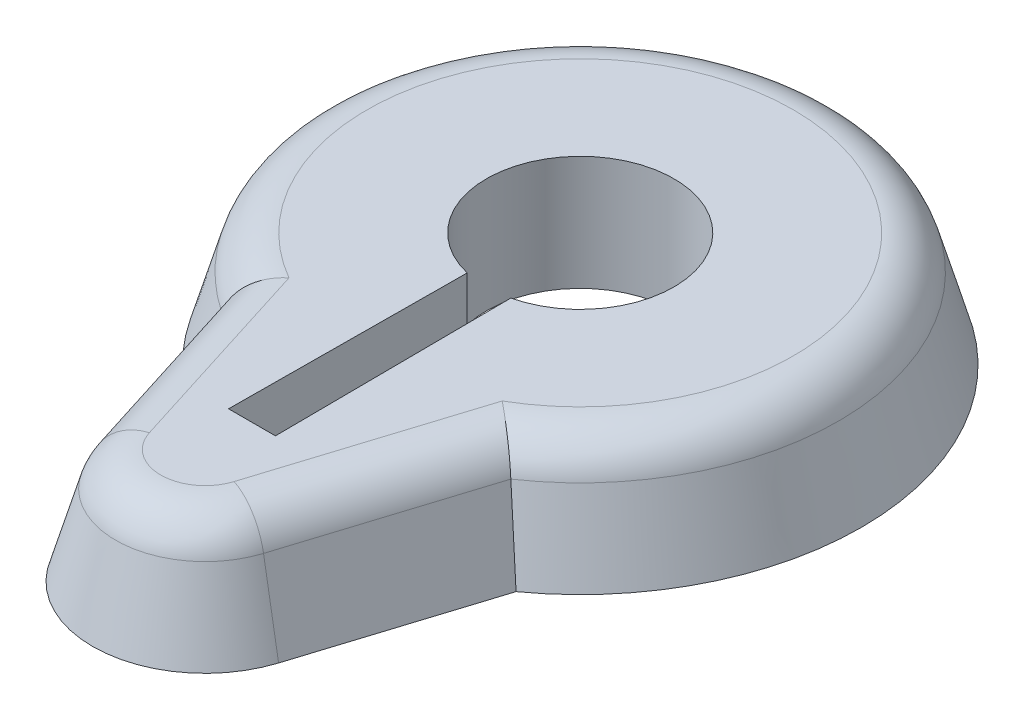
ISO-10303-21;
HEADER;
FILE_DESCRIPTION(('STEP AP214'),'2;1');
FILE_NAME('part.step','',(''),(''),'','','');
FILE_SCHEMA(('AUTOMOTIVE_DESIGN { 1 0 10303 214 1 1 1 1 }'));
ENDSEC;
DATA;
#1=APPLICATION_CONTEXT('core data for automotive mechanical design processes');
#2=APPLICATION_PROTOCOL_DEFINITION('international standard','automotive_design',2000,#1);
#3=PRODUCT_CONTEXT('',#1,'mechanical');
#4=PRODUCT('Part','Part','',(#3));
#5=PRODUCT_RELATED_PRODUCT_CATEGORY('part','',(#4));
#6=PRODUCT_DEFINITION_FORMATION('','',#4);
#7=PRODUCT_DEFINITION_CONTEXT('part definition',#1,'design');
#8=PRODUCT_DEFINITION('design','',#6,#7);
#9=PRODUCT_DEFINITION_SHAPE('','',#8);
#10=(LENGTH_UNIT() NAMED_UNIT(*) SI_UNIT(.MILLI.,.METRE.));
#11=(NAMED_UNIT(*) PLANE_ANGLE_UNIT() SI_UNIT($,.RADIAN.));
#12=(NAMED_UNIT(*) SI_UNIT($,.STERADIAN.) SOLID_ANGLE_UNIT());
#13=UNCERTAINTY_MEASURE_WITH_UNIT(LENGTH_MEASURE(1.E-05),#10,'distance_accuracy_value','');
#14=(GEOMETRIC_REPRESENTATION_CONTEXT(3) GLOBAL_UNCERTAINTY_ASSIGNED_CONTEXT((#13)) GLOBAL_UNIT_ASSIGNED_CONTEXT((#10,
#11,#12)) REPRESENTATION_CONTEXT('',''));
#15=CARTESIAN_POINT('',(0.,0.,0.));
#16=DIRECTION('',(0.,0.,1.));
#17=DIRECTION('',(1.,0.,0.));
#18=AXIS2_PLACEMENT_3D('',#15,#16,#17);
#19=CARTESIAN_POINT('',(0.,0.,-2.));
#20=DIRECTION('',(0.,-1.,0.));
#21=DIRECTION('',(0.,0.,1.));
#22=AXIS2_PLACEMENT_3D('',#19,#20,#21);
#23=CONICAL_SURFACE('',#22,1.5,0.279252680319093);
#24=CARTESIAN_POINT('',(-0.727011983445059,0.61,-0.892162165690795));
#25=CARTESIAN_POINT('',(-0.751687573822711,0.508364701078638,-0.873506309394445));
#26=CARTESIAN_POINT('',(-0.776419229257601,0.406713709937173,-0.855013305041109));
#27=CARTESIAN_POINT('',(-0.825994662103472,0.203380376593568,-0.818353006238683));
#28=CARTESIAN_POINT('',(-0.850838439477637,0.101698034401733,-0.800185711682655));
#29=CARTESIAN_POINT('',(-0.875738281872226,0.,-0.782181268962706));
#30=B_SPLINE_CURVE_WITH_KNOTS('',3,(#24,#25,#26,#27,#28,#29),.UNSPECIFIED.,.F.,.F.,(4,2,4),(0.,
0.318714809689546,0.63742951473762),.UNSPECIFIED.);
#31=CARTESIAN_POINT('',(-0.771031625107619,0.428909338953996,-0.859091193810965));
#32=VERTEX_POINT('',#31);
#33=CARTESIAN_POINT('',(-0.875738281872566,0.,-0.78218126896369));
#34=VERTEX_POINT('',#33);
#35=EDGE_CURVE('E161',#32,#34,#30,.T.);
#36=ORIENTED_EDGE('',*,*,#35,.F.);
#37=CARTESIAN_POINT('',(0.,0.42890933895425,-2.));
#38=DIRECTION('',(0.,-1.,0.));
#39=DIRECTION('',(0.,0.,-1.));
#40=AXIS2_PLACEMENT_3D('',#37,#38,#39);
#41=CIRCLE('',#40,1.37701222614601);
#42=CARTESIAN_POINT('',(0.771031625107556,0.428909338954256,-0.859091193811012));
#43=VERTEX_POINT('',#42);
#44=EDGE_CURVE('E11',#32,#43,#41,.T.);
#45=ORIENTED_EDGE('',*,*,#44,.T.);
#46=CARTESIAN_POINT('',(0.727011983445059,0.61,-0.892162165690795));
#47=CARTESIAN_POINT('',(0.751687573822711,0.508364701078638,-0.873506309394445));
#48=CARTESIAN_POINT('',(0.776419229257601,0.406713709937173,-0.855013305041109));
#49=CARTESIAN_POINT('',(0.825994662103471,0.203380376593568,-0.818353006238682));
#50=CARTESIAN_POINT('',(0.850838439477637,0.101698034401733,-0.800185711682655));
#51=CARTESIAN_POINT('',(0.875738281872225,0.,-0.782181268962706));
#52=B_SPLINE_CURVE_WITH_KNOTS('',3,(#46,#47,#48,#49,#50,#51),.UNSPECIFIED.,.F.,.F.,(4,2,4),(0.,
0.318714809689546,0.63742951473762),.UNSPECIFIED.);
#53=CARTESIAN_POINT('',(0.875738281872565,0.,-0.782181268963691));
#54=VERTEX_POINT('',#53);
#55=EDGE_CURVE('E160',#43,#54,#52,.T.);
#56=ORIENTED_EDGE('',*,*,#55,.T.);
#57=CARTESIAN_POINT('',(0.,0.,-2.));
#58=DIRECTION('',(0.,1.,0.));
#59=DIRECTION('',(0.,0.,1.));
#60=AXIS2_PLACEMENT_3D('',#57,#58,#59);
#61=CIRCLE('',#60,1.5);
#62=EDGE_CURVE('E148',#54,#34,#61,.T.);
#63=ORIENTED_EDGE('',*,*,#62,.T.);
#64=EDGE_LOOP('',(#36,#45,#56,#63));
#65=FACE_BOUND('',#64,.T.);
#66=ADVANCED_FACE('F33',(#65),#23,.T.);
#67=CARTESIAN_POINT('',(-0.875738281872566,0.,-0.78218126896369));
#68=DIRECTION('',(-0.916771573521362,0.275637355817,0.289056966809966));
#69=DIRECTION('',(0.300705799504274,0.,0.953716950748227));
#70=AXIS2_PLACEMENT_3D('',#67,#68,#69);
#71=PLANE('',#70);
#72=DIRECTION('',(-0.262880018502093,-0.961261695938319,0.0828857514541949));
#73=VECTOR('',#72,1.);
#74=CARTESIAN_POINT('',(-0.572230170448936,0.,0.180423479702564));
#75=LINE('',#74,#73);
#76=CARTESIAN_POINT('',(-0.454934645789594,0.42890933895425,0.143440342836549));
#77=VERTEX_POINT('',#76);
#78=CARTESIAN_POINT('',(-0.572230170448936,0.,0.180423479702564));
#79=VERTEX_POINT('',#78);
#80=EDGE_CURVE('E170',#77,#79,#75,.T.);
#81=ORIENTED_EDGE('',*,*,#80,.F.);
#82=DIRECTION('',(0.300705799504274,0.,0.953716950748227));
#83=VECTOR('',#82,1.);
#84=CARTESIAN_POINT('',(-0.776535559103396,0.42890933895425,-0.876547442264764));
#85=LINE('',#84,#83);
#86=EDGE_CURVE('E42',#77,#32,#85,.F.);
#87=ORIENTED_EDGE('',*,*,#86,.T.);
#88=ORIENTED_EDGE('',*,*,#35,.T.);
#89=DIRECTION('',(0.300705799504274,0.,0.953716950748227));
#90=VECTOR('',#89,1.);
#91=CARTESIAN_POINT('',(-0.875738281872566,0.,-0.78218126896369));
#92=LINE('',#91,#90);
#93=EDGE_CURVE('E151',#34,#79,#92,.T.);
#94=ORIENTED_EDGE('',*,*,#93,.T.);
#95=EDGE_LOOP('',(#81,#87,#88,#94));
#96=FACE_BOUND('',#95,.T.);
#97=ADVANCED_FACE('F179',(#96),#71,.T.);
#98=CARTESIAN_POINT('',(0.,0.,0.));
#99=DIRECTION('',(0.,-1.,0.));
#100=DIRECTION('',(0.,0.,-1.));
#101=AXIS2_PLACEMENT_3D('',#98,#99,#100);
#102=CONICAL_SURFACE('',#101,0.6,0.279252680319093);
#103=DIRECTION('',(0.262880018502093,-0.961261695938319,0.0828857514541949));
#104=VECTOR('',#103,1.);
#105=CARTESIAN_POINT('',(0.572230170448936,0.,0.180423479702564));
#106=LINE('',#105,#104);
#107=CARTESIAN_POINT('',(0.454934645789594,0.42890933895425,0.143440342836549));
#108=VERTEX_POINT('',#107);
#109=CARTESIAN_POINT('',(0.572230170448936,0.,0.180423479702564));
#110=VERTEX_POINT('',#109);
#111=EDGE_CURVE('E254',#108,#110,#106,.T.);
#112=ORIENTED_EDGE('',*,*,#111,.F.);
#113=CARTESIAN_POINT('',(0.,0.42890933895425,0.));
#114=DIRECTION('',(0.,-1.,0.));
#115=DIRECTION('',(0.,0.,-1.));
#116=AXIS2_PLACEMENT_3D('',#113,#114,#115);
#117=CIRCLE('',#116,0.477012226146008);
#118=EDGE_CURVE('E250',#108,#77,#117,.T.);
#119=ORIENTED_EDGE('',*,*,#118,.T.);
#120=ORIENTED_EDGE('',*,*,#80,.T.);
#121=CARTESIAN_POINT('',(0.,0.,0.));
#122=DIRECTION('',(0.,1.,0.));
#123=DIRECTION('',(0.,0.,-1.));
#124=AXIS2_PLACEMENT_3D('',#121,#122,#123);
#125=CIRCLE('',#124,0.6);
#126=EDGE_CURVE('E154',#79,#110,#125,.T.);
#127=ORIENTED_EDGE('',*,*,#126,.T.);
#128=EDGE_LOOP('',(#112,#119,#120,#127));
#129=FACE_BOUND('',#128,.T.);
#130=ADVANCED_FACE('F182',(#129),#102,.T.);
#131=CARTESIAN_POINT('',(0.875738281872565,0.,-0.782181268963691));
#132=DIRECTION('',(0.916771573521362,0.275637355817,0.289056966809966));
#133=DIRECTION('',(0.300705799504274,0.,-0.953716950748227));
#134=AXIS2_PLACEMENT_3D('',#131,#132,#133);
#135=PLANE('',#134);
#136=ORIENTED_EDGE('',*,*,#55,.F.);
#137=DIRECTION('',(0.300705799504274,0.,-0.953716950748227));
#138=VECTOR('',#137,1.);
#139=CARTESIAN_POINT('',(0.454934645789594,0.42890933895425,0.143440342836548));
#140=LINE('',#139,#138);
#141=EDGE_CURVE('E247',#43,#108,#140,.F.);
#142=ORIENTED_EDGE('',*,*,#141,.T.);
#143=ORIENTED_EDGE('',*,*,#111,.T.);
#144=DIRECTION('',(0.300705799504274,0.,-0.953716950748227));
#145=VECTOR('',#144,1.);
#146=CARTESIAN_POINT('',(0.875738281872565,0.,-0.782181268963691));
#147=LINE('',#146,#145);
#148=EDGE_CURVE('E157',#110,#54,#147,.T.);
#149=ORIENTED_EDGE('',*,*,#148,.T.);
#150=EDGE_LOOP('',(#136,#142,#143,#149));
#151=FACE_BOUND('',#150,.T.);
#152=ADVANCED_FACE('F184',(#151),#135,.T.);
#153=CARTESIAN_POINT('',(0.,0.61,-2.));
#154=DIRECTION('',(0.,1.,0.));
#155=DIRECTION('',(0.,0.,1.));
#156=AXIS2_PLACEMENT_3D('',#153,#154,#155);
#157=PLANE('',#156);
#158=DIRECTION('',(1.,0.,0.));
#159=VECTOR('',#158,1.);
#160=CARTESIAN_POINT('',(-0.125,0.61,-0.25));
#161=LINE('',#160,#159);
#162=CARTESIAN_POINT('',(-0.125,0.61,-0.25));
#163=VERTEX_POINT('',#162);
#164=CARTESIAN_POINT('',(0.125,0.61,-0.25));
#165=VERTEX_POINT('',#164);
#166=EDGE_CURVE('E50',#163,#165,#161,.T.);
#167=ORIENTED_EDGE('',*,*,#166,.F.);
#168=DIRECTION('',(-0.00694983804507707,0.,0.999975849583952));
#169=VECTOR('',#168,1.);
#170=CARTESIAN_POINT('',(-0.116217319320766,0.61,-1.51369399069115));
#171=LINE('',#170,#169);
#172=CARTESIAN_POINT('',(-0.116217319320767,0.61,-1.51369399069115));
#173=VERTEX_POINT('',#172);
#174=EDGE_CURVE('E129',#173,#163,#171,.T.);
#175=ORIENTED_EDGE('',*,*,#174,.F.);
#176=CARTESIAN_POINT('',(0.,0.61,-2.));
#177=DIRECTION('',(0.,1.,0.));
#178=DIRECTION('',(0.,0.,1.));
#179=AXIS2_PLACEMENT_3D('',#176,#177,#178);
#180=CIRCLE('',#179,0.5);
#181=CARTESIAN_POINT('',(0.116217319320766,0.61,-1.51369399069115));
#182=VERTEX_POINT('',#181);
#183=EDGE_CURVE('E132',#182,#173,#180,.T.);
#184=ORIENTED_EDGE('',*,*,#183,.F.);
#185=DIRECTION('',(-0.00694983804507782,0.,-0.999975849583952));
#186=VECTOR('',#185,1.);
#187=CARTESIAN_POINT('',(0.116217319320766,0.61,-1.51369399069115));
#188=LINE('',#187,#186);
#189=EDGE_CURVE('E138',#165,#182,#188,.T.);
#190=ORIENTED_EDGE('',*,*,#189,.F.);
#191=EDGE_LOOP('',(#167,#175,#184,#190));
#192=FACE_BOUND('',#191,.T.);
#193=CARTESIAN_POINT('',(0.,0.61,0.));
#194=DIRECTION('',(0.,1.,0.));
#195=DIRECTION('',(0.,0.,1.));
#196=AXIS2_PLACEMENT_3D('',#193,#194,#195);
#197=CIRCLE('',#196,0.236696802161428);
#198=CARTESIAN_POINT('',(-0.225741752409254,0.61,0.0711761011340573));
#199=VERTEX_POINT('',#198);
#200=CARTESIAN_POINT('',(0.225741752409254,0.61,0.0711761011340572));
#201=VERTEX_POINT('',#200);
#202=EDGE_CURVE('E262',#199,#201,#197,.T.);
#203=ORIENTED_EDGE('',*,*,#202,.T.);
#204=DIRECTION('',(-0.300705799504274,0.,0.953716950748227));
#205=VECTOR('',#204,1.);
#206=CARTESIAN_POINT('',(0.547342665723056,0.61,-0.948811683967256));
#207=LINE('',#206,#205);
#208=CARTESIAN_POINT('',(0.568409432491153,0.61,-1.01562693195156));
#209=VERTEX_POINT('',#208);
#210=EDGE_CURVE('E248',#201,#209,#207,.F.);
#211=ORIENTED_EDGE('',*,*,#210,.T.);
#212=CARTESIAN_POINT('',(0.,0.61,-2.));
#213=DIRECTION('',(0.,1.,0.));
#214=DIRECTION('',(0.,0.,1.));
#215=AXIS2_PLACEMENT_3D('',#212,#213,#214);
#216=CIRCLE('',#215,1.13669680216143);
#217=CARTESIAN_POINT('',(-0.568409432491153,0.61,-1.01562693195156));
#218=VERTEX_POINT('',#217);
#219=EDGE_CURVE('E169',#209,#218,#216,.T.);
#220=ORIENTED_EDGE('',*,*,#219,.T.);
#221=DIRECTION('',(-0.300705799504274,0.,-0.953716950748227));
#222=VECTOR('',#221,1.);
#223=CARTESIAN_POINT('',(-0.225741752409254,0.61,0.0711761011340573));
#224=LINE('',#223,#222);
#225=EDGE_CURVE('E237',#218,#199,#224,.F.);
#226=ORIENTED_EDGE('',*,*,#225,.T.);
#227=EDGE_LOOP('',(#203,#211,#220,#226));
#228=FACE_BOUND('',#227,.T.);
#229=ADVANCED_FACE('F188',(#192,#228),#157,.T.);
#230=CARTESIAN_POINT('',(0.,0.,-2.));
#231=DIRECTION('',(0.,1.,0.));
#232=DIRECTION('',(0.,0.,1.));
#233=AXIS2_PLACEMENT_3D('',#230,#231,#232);
#234=PLANE('',#233);
#235=DIRECTION('',(-0.00694983804507707,0.,0.999975849583952));
#236=VECTOR('',#235,1.);
#237=CARTESIAN_POINT('',(-0.116217319320766,0.,-1.51369399069115));
#238=LINE('',#237,#236);
#239=CARTESIAN_POINT('',(-0.116217319320767,0.,-1.51369399069115));
#240=VERTEX_POINT('',#239);
#241=CARTESIAN_POINT('',(-0.125,0.,-0.25));
#242=VERTEX_POINT('',#241);
#243=EDGE_CURVE('E119',#240,#242,#238,.T.);
#244=ORIENTED_EDGE('',*,*,#243,.T.);
#245=DIRECTION('',(1.,0.,0.));
#246=VECTOR('',#245,1.);
#247=CARTESIAN_POINT('',(-0.125,0.,-0.25));
#248=LINE('',#247,#246);
#249=CARTESIAN_POINT('',(0.125,0.,-0.25));
#250=VERTEX_POINT('',#249);
#251=EDGE_CURVE('E113',#242,#250,#248,.T.);
#252=ORIENTED_EDGE('',*,*,#251,.T.);
#253=DIRECTION('',(-0.00694983804507782,0.,-0.999975849583952));
#254=VECTOR('',#253,1.);
#255=CARTESIAN_POINT('',(0.116217319320766,0.,-1.51369399069115));
#256=LINE('',#255,#254);
#257=CARTESIAN_POINT('',(0.116217319320766,0.,-1.51369399069115));
#258=VERTEX_POINT('',#257);
#259=EDGE_CURVE('E122',#250,#258,#256,.T.);
#260=ORIENTED_EDGE('',*,*,#259,.T.);
#261=CARTESIAN_POINT('',(0.,0.,-2.));
#262=DIRECTION('',(0.,1.,0.));
#263=DIRECTION('',(0.,0.,1.));
#264=AXIS2_PLACEMENT_3D('',#261,#262,#263);
#265=CIRCLE('',#264,0.5);
#266=EDGE_CURVE('E58',#258,#240,#265,.T.);
#267=ORIENTED_EDGE('',*,*,#266,.T.);
#268=EDGE_LOOP('',(#244,#252,#260,#267));
#269=FACE_BOUND('',#268,.T.);
#270=ORIENTED_EDGE('',*,*,#62,.F.);
#271=ORIENTED_EDGE('',*,*,#148,.F.);
#272=ORIENTED_EDGE('',*,*,#126,.F.);
#273=ORIENTED_EDGE('',*,*,#93,.F.);
#274=EDGE_LOOP('',(#270,#271,#272,#273));
#275=FACE_BOUND('',#274,.T.);
#276=ADVANCED_FACE('F126',(#269,#275),#234,.F.);
#277=CARTESIAN_POINT('',(-0.799318188760301,0.36,-1.74797594315493));
#278=DIRECTION('',(0.300705799504274,0.,0.953716950748227));
#279=DIRECTION('',(0.953716950748227,0.,-0.300705799504274));
#280=AXIS2_PLACEMENT_3D('',#277,#278,#279);
#281=CYLINDRICAL_SURFACE('',#280,0.25);
#282=CARTESIAN_POINT('',(-0.771031625108328,0.42890933895425,-0.859091193810624));
#283=CARTESIAN_POINT('',(-0.767799262563599,0.442238581471238,-0.86150342302159));
#284=CARTESIAN_POINT('',(-0.76361772747508,0.455193377094432,-0.864625885062025));
#285=CARTESIAN_POINT('',(-0.753577571194484,0.479996157110056,-0.872145183572054));
#286=CARTESIAN_POINT('',(-0.74772370090185,0.491847152553646,-0.876538410390899));
#287=CARTESIAN_POINT('',(-0.734543691073227,0.514156115164229,-0.886465175509808));
#288=CARTESIAN_POINT('',(-0.727218465640971,0.52461494056501,-0.891998005866337));
#289=CARTESIAN_POINT('',(-0.711341397461259,0.543915838994019,-0.904042111151662));
#290=CARTESIAN_POINT('',(-0.702789038798912,0.552757228440446,-0.910553797669139));
#291=CARTESIAN_POINT('',(-0.684383343693213,0.568940392330476,-0.924637689197919));
#292=CARTESIAN_POINT('',(-0.674493309620122,0.576213701909257,-0.932240452573155));
#293=CARTESIAN_POINT('',(-0.653968071242142,0.588699295783088,-0.948110806302974));
#294=CARTESIAN_POINT('',(-0.64333254791265,0.593910691285528,-0.95637868151172));
#295=CARTESIAN_POINT('',(-0.622524998478746,0.601847236074328,-0.972657101905258));
#296=CARTESIAN_POINT('',(-0.612388954063003,0.60474430148759,-0.98063103484083));
#297=CARTESIAN_POINT('',(-0.591962434085602,0.608717935771284,-0.996800167879044));
#298=CARTESIAN_POINT('',(-0.581672312355554,0.609798175051525,-1.00499488780853));
#299=CARTESIAN_POINT('',(-0.570410043642453,0.60999144965831,-1.01402187421955));
#300=CARTESIAN_POINT('',(-0.569409548236555,0.610000024447812,-1.0148243007258));
#301=CARTESIAN_POINT('',(-0.568409432491156,0.61,-1.01562693195156));
#302=B_SPLINE_CURVE_WITH_KNOTS('',3,(#282,#283,#284,#285,#286,#287,#288,#289,#290,#291,#292,
#293,#294,#295,#296,#297,#298,#299,#300,#301),.UNSPECIFIED.,.F.,.F.,(4,2,2,2,2,2,2,2,2,4),(0.,
0.0417034413969904,0.0832895668965742,0.124849935797009,0.166427829105124,0.209560971926362,
0.252712687180587,0.292243861701843,0.331695077734615,0.3355426142289),.UNSPECIFIED.);
#303=EDGE_CURVE('E207',#32,#218,#302,.T.);
#304=ORIENTED_EDGE('',*,*,#303,.F.);
#305=ORIENTED_EDGE('',*,*,#86,.F.);
#306=CARTESIAN_POINT('',(-0.225741752409254,0.36,0.0711761011340573));
#307=DIRECTION('',(0.300705799504274,0.,0.953716950748227));
#308=DIRECTION('',(0.953716950748227,0.,-0.300705799504274));
#309=AXIS2_PLACEMENT_3D('',#306,#307,#308);
#310=CIRCLE('',#309,0.25);
#311=EDGE_CURVE('E37',#199,#77,#310,.T.);
#312=ORIENTED_EDGE('',*,*,#311,.F.);
#313=ORIENTED_EDGE('',*,*,#225,.F.);
#314=EDGE_LOOP('',(#304,#305,#312,#313));
#315=FACE_BOUND('',#314,.T.);
#316=ADVANCED_FACE('F214',(#315),#281,.T.);
#317=CARTESIAN_POINT('',(0.,0.36,0.));
#318=DIRECTION('',(0.,1.,0.));
#319=DIRECTION('',(0.,0.,1.));
#320=AXIS2_PLACEMENT_3D('',#317,#318,#319);
#321=DEGENERATE_TOROIDAL_SURFACE('',#320,0.236696802161428,0.25,.T.);
#322=ORIENTED_EDGE('',*,*,#311,.T.);
#323=ORIENTED_EDGE('',*,*,#118,.F.);
#324=CARTESIAN_POINT('',(0.225741752409254,0.36,0.0711761011340572));
#325=DIRECTION('',(0.300705799504274,0.,-0.953716950748227));
#326=DIRECTION('',(-0.953716950748227,0.,-0.300705799504274));
#327=AXIS2_PLACEMENT_3D('',#324,#325,#326);
#328=CIRCLE('',#327,0.25);
#329=EDGE_CURVE('E213',#201,#108,#328,.T.);
#330=ORIENTED_EDGE('',*,*,#329,.F.);
#331=ORIENTED_EDGE('',*,*,#202,.F.);
#332=EDGE_LOOP('',(#322,#323,#330,#331));
#333=FACE_BOUND('',#332,.T.);
#334=ADVANCED_FACE('F35',(#333),#321,.T.);
#335=CARTESIAN_POINT('',(0.,0.36,-2.));
#336=DIRECTION('',(0.,1.,0.));
#337=DIRECTION('',(0.,0.,1.));
#338=AXIS2_PLACEMENT_3D('',#335,#336,#337);
#339=TOROIDAL_SURFACE('',#338,1.13669680216143,0.25);
#340=ORIENTED_EDGE('',*,*,#303,.T.);
#341=ORIENTED_EDGE('',*,*,#219,.F.);
#342=CARTESIAN_POINT('',(0.771031625107557,0.42890933895425,-0.859091193811012));
#343=CARTESIAN_POINT('',(0.76779926256326,0.442238581471427,-0.861503423021775));
#344=CARTESIAN_POINT('',(0.763617727474911,0.455193377094694,-0.864625885062133));
#345=CARTESIAN_POINT('',(0.753577571194432,0.479996157110338,-0.872145183572111));
#346=CARTESIAN_POINT('',(0.747723700901748,0.491847152553878,-0.87653841039098));
#347=CARTESIAN_POINT('',(0.734543691073086,0.514156115164407,-0.886465175509909));
#348=CARTESIAN_POINT('',(0.727218465640838,0.524614940565181,-0.891998005866437));
#349=CARTESIAN_POINT('',(0.711341397461122,0.543915838994176,-0.904042111151768));
#350=CARTESIAN_POINT('',(0.702789038798763,0.552757228440595,-0.910553797669253));
#351=CARTESIAN_POINT('',(0.684383343693044,0.568940392330607,-0.924637689198048));
#352=CARTESIAN_POINT('',(0.674493309619946,0.576213701909378,-0.932240452573291));
#353=CARTESIAN_POINT('',(0.653968071241954,0.588699295783187,-0.948110806303119));
#354=CARTESIAN_POINT('',(0.643332547912457,0.593910691285615,-0.956378681511868));
#355=CARTESIAN_POINT('',(0.622524998478583,0.601847236074378,-0.972657101905388));
#356=CARTESIAN_POINT('',(0.612388954062874,0.604744301487622,-0.980631034840937));
#357=CARTESIAN_POINT('',(0.591962434085532,0.608717935771291,-0.996800167879093));
#358=CARTESIAN_POINT('',(0.58167231235551,0.609798175051526,-1.00499488780854));
#359=CARTESIAN_POINT('',(0.570410043642451,0.60999144965831,-1.01402187421955));
#360=CARTESIAN_POINT('',(0.569409548236554,0.610000024447812,-1.0148243007258));
#361=CARTESIAN_POINT('',(0.568409432491156,0.61,-1.01562693195156));
#362=B_SPLINE_CURVE_WITH_KNOTS('',3,(#342,#343,#344,#345,#346,#347,#348,#349,#350,#351,#352,
#353,#354,#355,#356,#357,#358,#359,#360,#361),.UNSPECIFIED.,.F.,.F.,(4,2,2,2,2,2,2,2,2,4),(0.,
0.0417034413969896,0.0832895668965027,0.124849935796924,0.16642782910505,0.209560971926301,
0.252712687180528,0.292243861701653,0.331695077734298,0.335542614228583),.UNSPECIFIED.);
#363=EDGE_CURVE('E144',#43,#209,#362,.T.);
#364=ORIENTED_EDGE('',*,*,#363,.F.);
#365=ORIENTED_EDGE('',*,*,#44,.F.);
#366=EDGE_LOOP('',(#340,#341,#364,#365));
#367=FACE_BOUND('',#366,.T.);
#368=ADVANCED_FACE('F193',(#367),#339,.T.);
#369=CARTESIAN_POINT('',(0.799318188760301,0.36,-1.74797594315493));
#370=DIRECTION('',(0.300705799504274,0.,-0.953716950748227));
#371=DIRECTION('',(-0.953716950748227,0.,-0.300705799504274));
#372=AXIS2_PLACEMENT_3D('',#369,#370,#371);
#373=CYLINDRICAL_SURFACE('',#372,0.25);
#374=ORIENTED_EDGE('',*,*,#329,.T.);
#375=ORIENTED_EDGE('',*,*,#141,.F.);
#376=ORIENTED_EDGE('',*,*,#363,.T.);
#377=ORIENTED_EDGE('',*,*,#210,.F.);
#378=EDGE_LOOP('',(#374,#375,#376,#377));
#379=FACE_BOUND('',#378,.T.);
#380=ADVANCED_FACE('F197',(#379),#373,.T.);
#381=CARTESIAN_POINT('',(-0.125,0.,-0.25));
#382=DIRECTION('',(0.,0.,1.));
#383=DIRECTION('',(1.,0.,0.));
#384=AXIS2_PLACEMENT_3D('',#381,#382,#383);
#385=PLANE('',#384);
#386=ORIENTED_EDGE('',*,*,#166,.T.);
#387=DIRECTION('',(0.,1.,0.));
#388=VECTOR('',#387,1.);
#389=CARTESIAN_POINT('',(0.125,0.,-0.25));
#390=LINE('',#389,#388);
#391=EDGE_CURVE('E109',#250,#165,#390,.T.);
#392=ORIENTED_EDGE('',*,*,#391,.F.);
#393=ORIENTED_EDGE('',*,*,#251,.F.);
#394=DIRECTION('',(0.,1.,0.));
#395=VECTOR('',#394,1.);
#396=CARTESIAN_POINT('',(-0.125,0.,-0.25));
#397=LINE('',#396,#395);
#398=EDGE_CURVE('E142',#242,#163,#397,.T.);
#399=ORIENTED_EDGE('',*,*,#398,.T.);
#400=EDGE_LOOP('',(#386,#392,#393,#399));
#401=FACE_BOUND('',#400,.T.);
#402=ADVANCED_FACE('F111',(#401),#385,.F.);
#403=CARTESIAN_POINT('',(-0.116217319320766,0.,-1.51369399069115));
#404=DIRECTION('',(-0.999975849583952,0.,-0.00694983804507707));
#405=DIRECTION('',(-0.00694983804507707,0.,0.999975849583952));
#406=AXIS2_PLACEMENT_3D('',#403,#404,#405);
#407=PLANE('',#406);
#408=ORIENTED_EDGE('',*,*,#174,.T.);
#409=ORIENTED_EDGE('',*,*,#398,.F.);
#410=ORIENTED_EDGE('',*,*,#243,.F.);
#411=DIRECTION('',(0.,1.,0.));
#412=VECTOR('',#411,1.);
#413=CARTESIAN_POINT('',(-0.116217319320767,0.,-1.51369399069115));
#414=LINE('',#413,#412);
#415=EDGE_CURVE('E145',#240,#173,#414,.T.);
#416=ORIENTED_EDGE('',*,*,#415,.T.);
#417=EDGE_LOOP('',(#408,#409,#410,#416));
#418=FACE_BOUND('',#417,.T.);
#419=ADVANCED_FACE('F274',(#418),#407,.F.);
#420=CARTESIAN_POINT('',(0.,0.,-2.));
#421=DIRECTION('',(0.,1.,0.));
#422=DIRECTION('',(0.,0.,1.));
#423=AXIS2_PLACEMENT_3D('',#420,#421,#422);
#424=CYLINDRICAL_SURFACE('',#423,0.5);
#425=ORIENTED_EDGE('',*,*,#183,.T.);
#426=ORIENTED_EDGE('',*,*,#415,.F.);
#427=ORIENTED_EDGE('',*,*,#266,.F.);
#428=DIRECTION('',(0.,1.,0.));
#429=VECTOR('',#428,1.);
#430=CARTESIAN_POINT('',(0.116217319320766,0.,-1.51369399069115));
#431=LINE('',#430,#429);
#432=EDGE_CURVE('E118',#258,#182,#431,.T.);
#433=ORIENTED_EDGE('',*,*,#432,.T.);
#434=EDGE_LOOP('',(#425,#426,#427,#433));
#435=FACE_BOUND('',#434,.T.);
#436=ADVANCED_FACE('F277',(#435),#424,.F.);
#437=CARTESIAN_POINT('',(0.116217319320766,0.,-1.51369399069115));
#438=DIRECTION('',(0.999975849583952,0.,-0.00694983804507782));
#439=DIRECTION('',(-0.00694983804507782,0.,-0.999975849583952));
#440=AXIS2_PLACEMENT_3D('',#437,#438,#439);
#441=PLANE('',#440);
#442=ORIENTED_EDGE('',*,*,#189,.T.);
#443=ORIENTED_EDGE('',*,*,#432,.F.);
#444=ORIENTED_EDGE('',*,*,#259,.F.);
#445=ORIENTED_EDGE('',*,*,#391,.T.);
#446=EDGE_LOOP('',(#442,#443,#444,#445));
#447=FACE_BOUND('',#446,.T.);
#448=ADVANCED_FACE('F123',(#447),#441,.F.);
#449=CLOSED_SHELL('',(#66,#97,#130,#152,#229,#276,#316,#334,#368,#380,#402,#419,#436,#448));
#450=MANIFOLD_SOLID_BREP('B2',#449);
#451=ADVANCED_BREP_SHAPE_REPRESENTATION('',(#18,#450),#14);
#452=SHAPE_DEFINITION_REPRESENTATION(#9,#451);
ENDSEC;
END-ISO-10303-21;
